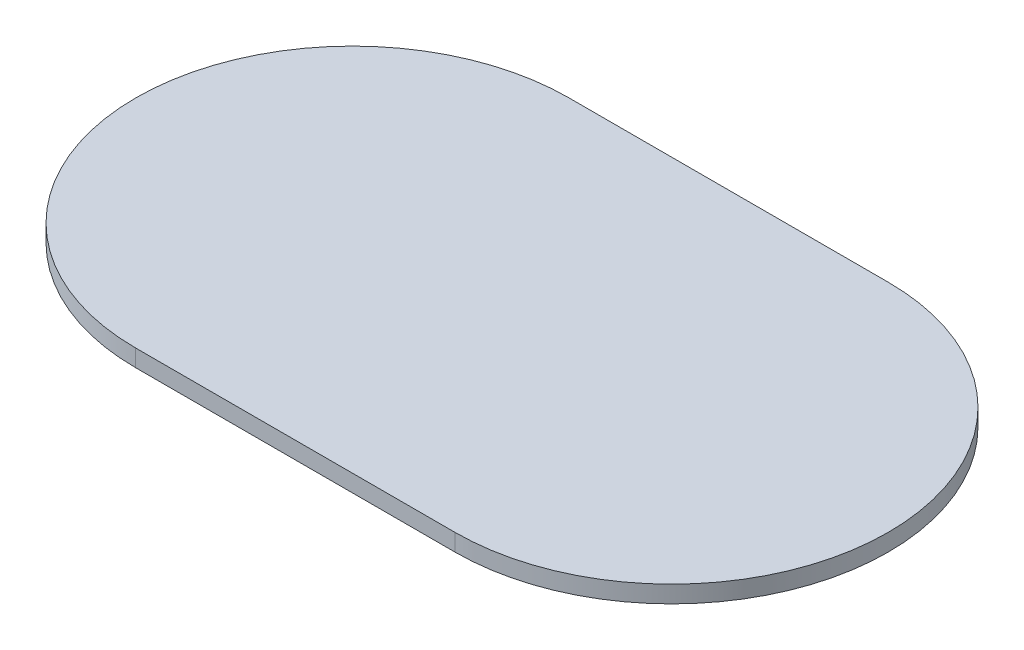
ISO-10303-21;
HEADER;
FILE_DESCRIPTION(('STEP AP214'),'2;1');
FILE_NAME('part.step','',(''),(''),'','','');
FILE_SCHEMA(('AUTOMOTIVE_DESIGN { 1 0 10303 214 1 1 1 1 }'));
ENDSEC;
DATA;
#1=APPLICATION_CONTEXT('core data for automotive mechanical design processes');
#2=APPLICATION_PROTOCOL_DEFINITION('international standard','automotive_design',2000,#1);
#3=PRODUCT_CONTEXT('',#1,'mechanical');
#4=PRODUCT('Part','Part','',(#3));
#5=PRODUCT_RELATED_PRODUCT_CATEGORY('part','',(#4));
#6=PRODUCT_DEFINITION_FORMATION('','',#4);
#7=PRODUCT_DEFINITION_CONTEXT('part definition',#1,'design');
#8=PRODUCT_DEFINITION('design','',#6,#7);
#9=PRODUCT_DEFINITION_SHAPE('','',#8);
#10=(LENGTH_UNIT() NAMED_UNIT(*) SI_UNIT(.MILLI.,.METRE.));
#11=(NAMED_UNIT(*) PLANE_ANGLE_UNIT() SI_UNIT($,.RADIAN.));
#12=(NAMED_UNIT(*) SI_UNIT($,.STERADIAN.) SOLID_ANGLE_UNIT());
#13=UNCERTAINTY_MEASURE_WITH_UNIT(LENGTH_MEASURE(1.E-05),#10,'distance_accuracy_value','');
#14=(GEOMETRIC_REPRESENTATION_CONTEXT(3) GLOBAL_UNCERTAINTY_ASSIGNED_CONTEXT((#13)) GLOBAL_UNIT_ASSIGNED_CONTEXT((#10,
#11,#12)) REPRESENTATION_CONTEXT('',''));
#15=CARTESIAN_POINT('',(0.,0.,0.));
#16=DIRECTION('',(0.,0.,1.));
#17=DIRECTION('',(1.,0.,0.));
#18=AXIS2_PLACEMENT_3D('',#15,#16,#17);
#19=CARTESIAN_POINT('',(28.,3.,0.));
#20=DIRECTION('',(0.,-1.,0.));
#21=DIRECTION('',(0.,0.,-1.));
#22=AXIS2_PLACEMENT_3D('',#19,#20,#21);
#23=CYLINDRICAL_SURFACE('',#22,38.);
#24=CARTESIAN_POINT('',(28.,0.,0.));
#25=DIRECTION('',(0.,1.,0.));
#26=DIRECTION('',(0.,0.,-1.));
#27=AXIS2_PLACEMENT_3D('',#24,#25,#26);
#28=CIRCLE('',#27,38.);
#29=CARTESIAN_POINT('',(28.,0.,38.));
#30=VERTEX_POINT('',#29);
#31=CARTESIAN_POINT('',(28.,0.,-38.));
#32=VERTEX_POINT('',#31);
#33=EDGE_CURVE('E104',#30,#32,#28,.T.);
#34=ORIENTED_EDGE('',*,*,#33,.T.);
#35=DIRECTION('',(0.,-1.,0.));
#36=VECTOR('',#35,1.);
#37=CARTESIAN_POINT('',(28.,3.,-38.));
#38=LINE('',#37,#36);
#39=CARTESIAN_POINT('',(28.,3.,-38.));
#40=VERTEX_POINT('',#39);
#41=EDGE_CURVE('E13',#40,#32,#38,.T.);
#42=ORIENTED_EDGE('',*,*,#41,.F.);
#43=CARTESIAN_POINT('',(28.,3.,0.));
#44=DIRECTION('',(0.,1.,0.));
#45=DIRECTION('',(0.,0.,-1.));
#46=AXIS2_PLACEMENT_3D('',#43,#44,#45);
#47=CIRCLE('',#46,38.);
#48=CARTESIAN_POINT('',(28.,3.,38.));
#49=VERTEX_POINT('',#48);
#50=EDGE_CURVE('E92',#49,#40,#47,.T.);
#51=ORIENTED_EDGE('',*,*,#50,.F.);
#52=DIRECTION('',(0.,-1.,0.));
#53=VECTOR('',#52,1.);
#54=CARTESIAN_POINT('',(28.,3.,38.));
#55=LINE('',#54,#53);
#56=EDGE_CURVE('E100',#49,#30,#55,.T.);
#57=ORIENTED_EDGE('',*,*,#56,.T.);
#58=EDGE_LOOP('',(#34,#42,#51,#57));
#59=FACE_BOUND('',#58,.T.);
#60=ADVANCED_FACE('F41',(#59),#23,.T.);
#61=CARTESIAN_POINT('',(-28.,3.,-38.));
#62=DIRECTION('',(0.,0.,1.));
#63=DIRECTION('',(1.,0.,0.));
#64=AXIS2_PLACEMENT_3D('',#61,#62,#63);
#65=PLANE('',#64);
#66=DIRECTION('',(-1.,0.,0.));
#67=VECTOR('',#66,1.);
#68=CARTESIAN_POINT('',(-28.,0.,-38.));
#69=LINE('',#68,#67);
#70=CARTESIAN_POINT('',(-28.,0.,-38.));
#71=VERTEX_POINT('',#70);
#72=EDGE_CURVE('E96',#32,#71,#69,.T.);
#73=ORIENTED_EDGE('',*,*,#72,.T.);
#74=DIRECTION('',(0.,-1.,0.));
#75=VECTOR('',#74,1.);
#76=CARTESIAN_POINT('',(-28.,3.,-38.));
#77=LINE('',#76,#75);
#78=CARTESIAN_POINT('',(-28.,3.,-38.));
#79=VERTEX_POINT('',#78);
#80=EDGE_CURVE('E49',#79,#71,#77,.T.);
#81=ORIENTED_EDGE('',*,*,#80,.F.);
#82=DIRECTION('',(-1.,0.,0.));
#83=VECTOR('',#82,1.);
#84=CARTESIAN_POINT('',(-28.,3.,-38.));
#85=LINE('',#84,#83);
#86=EDGE_CURVE('E87',#40,#79,#85,.T.);
#87=ORIENTED_EDGE('',*,*,#86,.F.);
#88=ORIENTED_EDGE('',*,*,#41,.T.);
#89=EDGE_LOOP('',(#73,#81,#87,#88));
#90=FACE_BOUND('',#89,.T.);
#91=ADVANCED_FACE('F95',(#90),#65,.F.);
#92=CARTESIAN_POINT('',(-28.,3.,0.));
#93=DIRECTION('',(0.,-1.,0.));
#94=DIRECTION('',(0.,0.,-1.));
#95=AXIS2_PLACEMENT_3D('',#92,#93,#94);
#96=CYLINDRICAL_SURFACE('',#95,38.);
#97=CARTESIAN_POINT('',(-28.,0.,0.));
#98=DIRECTION('',(0.,1.,0.));
#99=DIRECTION('',(0.,0.,1.));
#100=AXIS2_PLACEMENT_3D('',#97,#98,#99);
#101=CIRCLE('',#100,38.);
#102=CARTESIAN_POINT('',(-28.,0.,38.));
#103=VERTEX_POINT('',#102);
#104=EDGE_CURVE('E74',#71,#103,#101,.T.);
#105=ORIENTED_EDGE('',*,*,#104,.T.);
#106=DIRECTION('',(0.,-1.,0.));
#107=VECTOR('',#106,1.);
#108=CARTESIAN_POINT('',(-28.,3.,38.));
#109=LINE('',#108,#107);
#110=CARTESIAN_POINT('',(-28.,3.,38.));
#111=VERTEX_POINT('',#110);
#112=EDGE_CURVE('E97',#111,#103,#109,.T.);
#113=ORIENTED_EDGE('',*,*,#112,.F.);
#114=CARTESIAN_POINT('',(-28.,3.,0.));
#115=DIRECTION('',(0.,1.,0.));
#116=DIRECTION('',(0.,0.,1.));
#117=AXIS2_PLACEMENT_3D('',#114,#115,#116);
#118=CIRCLE('',#117,38.);
#119=EDGE_CURVE('E90',#79,#111,#118,.T.);
#120=ORIENTED_EDGE('',*,*,#119,.F.);
#121=ORIENTED_EDGE('',*,*,#80,.T.);
#122=EDGE_LOOP('',(#105,#113,#120,#121));
#123=FACE_BOUND('',#122,.T.);
#124=ADVANCED_FACE('F98',(#123),#96,.T.);
#125=CARTESIAN_POINT('',(-28.,3.,38.));
#126=DIRECTION('',(0.,0.,-1.));
#127=DIRECTION('',(-1.,0.,0.));
#128=AXIS2_PLACEMENT_3D('',#125,#126,#127);
#129=PLANE('',#128);
#130=DIRECTION('',(1.,0.,0.));
#131=VECTOR('',#130,1.);
#132=CARTESIAN_POINT('',(-28.,0.,38.));
#133=LINE('',#132,#131);
#134=EDGE_CURVE('E80',#103,#30,#133,.T.);
#135=ORIENTED_EDGE('',*,*,#134,.T.);
#136=ORIENTED_EDGE('',*,*,#56,.F.);
#137=DIRECTION('',(1.,0.,0.));
#138=VECTOR('',#137,1.);
#139=CARTESIAN_POINT('',(-28.,3.,38.));
#140=LINE('',#139,#138);
#141=EDGE_CURVE('E57',#111,#49,#140,.T.);
#142=ORIENTED_EDGE('',*,*,#141,.F.);
#143=ORIENTED_EDGE('',*,*,#112,.T.);
#144=EDGE_LOOP('',(#135,#136,#142,#143));
#145=FACE_BOUND('',#144,.T.);
#146=ADVANCED_FACE('F111',(#145),#129,.F.);
#147=CARTESIAN_POINT('',(28.,3.,0.));
#148=DIRECTION('',(0.,-1.,0.));
#149=DIRECTION('',(0.,0.,-1.));
#150=AXIS2_PLACEMENT_3D('',#147,#148,#149);
#151=PLANE('',#150);
#152=ORIENTED_EDGE('',*,*,#50,.T.);
#153=ORIENTED_EDGE('',*,*,#86,.T.);
#154=ORIENTED_EDGE('',*,*,#119,.T.);
#155=ORIENTED_EDGE('',*,*,#141,.T.);
#156=EDGE_LOOP('',(#152,#153,#154,#155));
#157=FACE_BOUND('',#156,.T.);
#158=ADVANCED_FACE('F88',(#157),#151,.F.);
#159=CARTESIAN_POINT('',(28.,0.,0.));
#160=DIRECTION('',(0.,-1.,0.));
#161=DIRECTION('',(0.,0.,-1.));
#162=AXIS2_PLACEMENT_3D('',#159,#160,#161);
#163=PLANE('',#162);
#164=ORIENTED_EDGE('',*,*,#33,.F.);
#165=ORIENTED_EDGE('',*,*,#134,.F.);
#166=ORIENTED_EDGE('',*,*,#104,.F.);
#167=ORIENTED_EDGE('',*,*,#72,.F.);
#168=EDGE_LOOP('',(#164,#165,#166,#167));
#169=FACE_BOUND('',#168,.T.);
#170=ADVANCED_FACE('F114',(#169),#163,.T.);
#171=CLOSED_SHELL('',(#60,#91,#124,#146,#158,#170));
#172=MANIFOLD_SOLID_BREP('B2',#171);
#173=ADVANCED_BREP_SHAPE_REPRESENTATION('',(#18,#172),#14);
#174=SHAPE_DEFINITION_REPRESENTATION(#9,#173);
ENDSEC;
END-ISO-10303-21;
